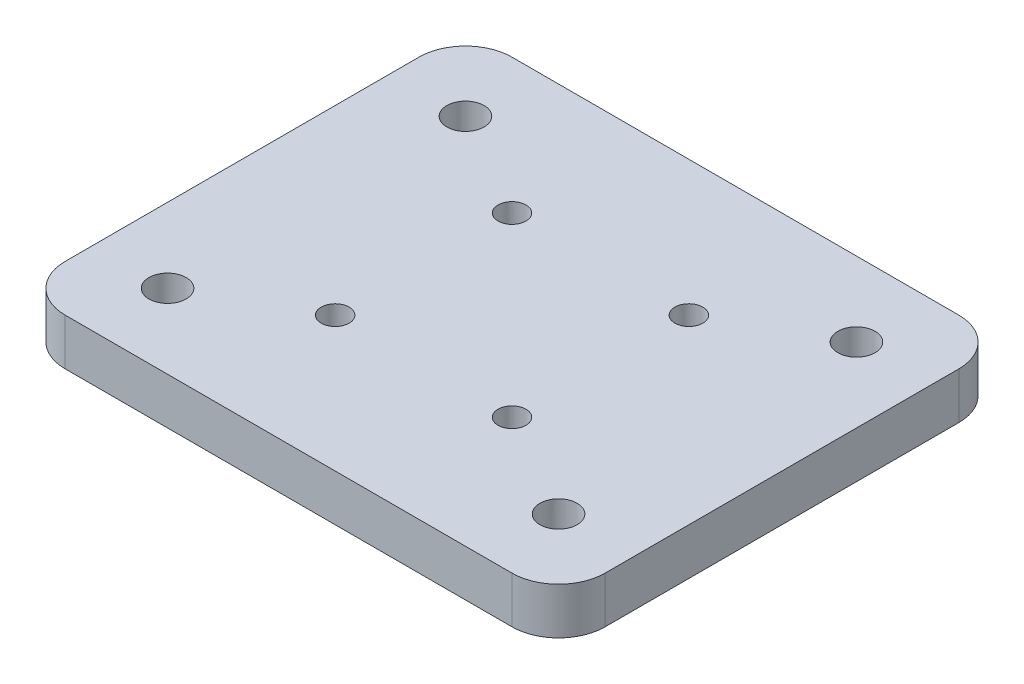
ISO-10303-21;
HEADER;
FILE_DESCRIPTION(('STEP AP214'),'2;1');
FILE_NAME('part.step','',(''),(''),'','','');
FILE_SCHEMA(('AUTOMOTIVE_DESIGN { 1 0 10303 214 1 1 1 1 }'));
ENDSEC;
DATA;
#1=APPLICATION_CONTEXT('core data for automotive mechanical design processes');
#2=APPLICATION_PROTOCOL_DEFINITION('international standard','automotive_design',2000,#1);
#3=PRODUCT_CONTEXT('',#1,'mechanical');
#4=PRODUCT('Part','Part','',(#3));
#5=PRODUCT_RELATED_PRODUCT_CATEGORY('part','',(#4));
#6=PRODUCT_DEFINITION_FORMATION('','',#4);
#7=PRODUCT_DEFINITION_CONTEXT('part definition',#1,'design');
#8=PRODUCT_DEFINITION('design','',#6,#7);
#9=PRODUCT_DEFINITION_SHAPE('','',#8);
#10=(LENGTH_UNIT() NAMED_UNIT(*) SI_UNIT(.MILLI.,.METRE.));
#11=(NAMED_UNIT(*) PLANE_ANGLE_UNIT() SI_UNIT($,.RADIAN.));
#12=(NAMED_UNIT(*) SI_UNIT($,.STERADIAN.) SOLID_ANGLE_UNIT());
#13=UNCERTAINTY_MEASURE_WITH_UNIT(LENGTH_MEASURE(1.E-05),#10,'distance_accuracy_value','');
#14=(GEOMETRIC_REPRESENTATION_CONTEXT(3) GLOBAL_UNCERTAINTY_ASSIGNED_CONTEXT((#13)) GLOBAL_UNIT_ASSIGNED_CONTEXT((#10,
#11,#12)) REPRESENTATION_CONTEXT('',''));
#15=CARTESIAN_POINT('',(0.,0.,0.));
#16=DIRECTION('',(0.,0.,1.));
#17=DIRECTION('',(1.,0.,0.));
#18=AXIS2_PLACEMENT_3D('',#15,#16,#17);
#19=CARTESIAN_POINT('',(-24.,5.,-19.));
#20=DIRECTION('',(0.,1.,0.));
#21=DIRECTION('',(0.,0.,1.));
#22=AXIS2_PLACEMENT_3D('',#19,#20,#21);
#23=CYLINDRICAL_SURFACE('',#22,5.);
#24=DIRECTION('',(0.,1.,0.));
#25=VECTOR('',#24,1.);
#26=CARTESIAN_POINT('',(-24.,5.,-24.));
#27=LINE('',#26,#25);
#28=CARTESIAN_POINT('',(-24.,0.,-24.));
#29=VERTEX_POINT('',#28);
#30=CARTESIAN_POINT('',(-24.,5.,-24.));
#31=VERTEX_POINT('',#30);
#32=EDGE_CURVE('E149',#29,#31,#27,.T.);
#33=ORIENTED_EDGE('',*,*,#32,.F.);
#34=CARTESIAN_POINT('',(-24.,0.,-19.));
#35=DIRECTION('',(0.,-1.,0.));
#36=DIRECTION('',(0.,0.,-1.));
#37=AXIS2_PLACEMENT_3D('',#34,#35,#36);
#38=CIRCLE('',#37,5.);
#39=CARTESIAN_POINT('',(-29.,0.,-19.));
#40=VERTEX_POINT('',#39);
#41=EDGE_CURVE('E43',#40,#29,#38,.T.);
#42=ORIENTED_EDGE('',*,*,#41,.F.);
#43=DIRECTION('',(0.,1.,0.));
#44=VECTOR('',#43,1.);
#45=CARTESIAN_POINT('',(-29.,5.,-19.));
#46=LINE('',#45,#44);
#47=CARTESIAN_POINT('',(-29.,5.,-19.));
#48=VERTEX_POINT('',#47);
#49=EDGE_CURVE('E103',#48,#40,#46,.F.);
#50=ORIENTED_EDGE('',*,*,#49,.F.);
#51=CARTESIAN_POINT('',(-24.,5.,-19.));
#52=DIRECTION('',(0.,-1.,0.));
#53=DIRECTION('',(0.,0.,-1.));
#54=AXIS2_PLACEMENT_3D('',#51,#52,#53);
#55=CIRCLE('',#54,5.);
#56=EDGE_CURVE('E11',#31,#48,#55,.F.);
#57=ORIENTED_EDGE('',*,*,#56,.F.);
#58=EDGE_LOOP('',(#33,#42,#50,#57));
#59=FACE_BOUND('',#58,.T.);
#60=ADVANCED_FACE('F36',(#59),#23,.T.);
#61=CARTESIAN_POINT('',(24.,5.,-19.));
#62=DIRECTION('',(0.,-1.,0.));
#63=DIRECTION('',(0.,0.,-1.));
#64=AXIS2_PLACEMENT_3D('',#61,#62,#63);
#65=CYLINDRICAL_SURFACE('',#64,5.);
#66=DIRECTION('',(0.,-1.,0.));
#67=VECTOR('',#66,1.);
#68=CARTESIAN_POINT('',(24.,5.,-24.));
#69=LINE('',#68,#67);
#70=CARTESIAN_POINT('',(24.,5.,-24.));
#71=VERTEX_POINT('',#70);
#72=CARTESIAN_POINT('',(24.,0.,-24.));
#73=VERTEX_POINT('',#72);
#74=EDGE_CURVE('E139',#71,#73,#69,.T.);
#75=ORIENTED_EDGE('',*,*,#74,.F.);
#76=CARTESIAN_POINT('',(24.,5.,-19.));
#77=DIRECTION('',(0.,-1.,0.));
#78=DIRECTION('',(0.,0.,-1.));
#79=AXIS2_PLACEMENT_3D('',#76,#77,#78);
#80=CIRCLE('',#79,5.);
#81=CARTESIAN_POINT('',(29.,5.,-19.));
#82=VERTEX_POINT('',#81);
#83=EDGE_CURVE('E145',#82,#71,#80,.F.);
#84=ORIENTED_EDGE('',*,*,#83,.F.);
#85=DIRECTION('',(0.,-1.,0.));
#86=VECTOR('',#85,1.);
#87=CARTESIAN_POINT('',(29.,5.,-19.));
#88=LINE('',#87,#86);
#89=CARTESIAN_POINT('',(29.,0.,-19.));
#90=VERTEX_POINT('',#89);
#91=EDGE_CURVE('E142',#90,#82,#88,.F.);
#92=ORIENTED_EDGE('',*,*,#91,.F.);
#93=CARTESIAN_POINT('',(24.,0.,-19.));
#94=DIRECTION('',(0.,-1.,0.));
#95=DIRECTION('',(0.,0.,-1.));
#96=AXIS2_PLACEMENT_3D('',#93,#94,#95);
#97=CIRCLE('',#96,5.);
#98=EDGE_CURVE('E147',#73,#90,#97,.T.);
#99=ORIENTED_EDGE('',*,*,#98,.F.);
#100=EDGE_LOOP('',(#75,#84,#92,#99));
#101=FACE_BOUND('',#100,.T.);
#102=ADVANCED_FACE('F235',(#101),#65,.T.);
#103=CARTESIAN_POINT('',(24.,5.,19.));
#104=DIRECTION('',(0.,-1.,0.));
#105=DIRECTION('',(0.,0.,-1.));
#106=AXIS2_PLACEMENT_3D('',#103,#104,#105);
#107=CYLINDRICAL_SURFACE('',#106,5.);
#108=DIRECTION('',(0.,-1.,0.));
#109=VECTOR('',#108,1.);
#110=CARTESIAN_POINT('',(29.,5.,19.));
#111=LINE('',#110,#109);
#112=CARTESIAN_POINT('',(29.,5.,19.));
#113=VERTEX_POINT('',#112);
#114=CARTESIAN_POINT('',(29.,0.,19.));
#115=VERTEX_POINT('',#114);
#116=EDGE_CURVE('E129',#113,#115,#111,.T.);
#117=ORIENTED_EDGE('',*,*,#116,.F.);
#118=CARTESIAN_POINT('',(24.,5.,19.));
#119=DIRECTION('',(0.,-1.,0.));
#120=DIRECTION('',(0.,0.,-1.));
#121=AXIS2_PLACEMENT_3D('',#118,#119,#120);
#122=CIRCLE('',#121,5.);
#123=CARTESIAN_POINT('',(24.,5.,24.));
#124=VERTEX_POINT('',#123);
#125=EDGE_CURVE('E135',#124,#113,#122,.F.);
#126=ORIENTED_EDGE('',*,*,#125,.F.);
#127=DIRECTION('',(0.,-1.,0.));
#128=VECTOR('',#127,1.);
#129=CARTESIAN_POINT('',(24.,5.,24.));
#130=LINE('',#129,#128);
#131=CARTESIAN_POINT('',(24.,0.,24.));
#132=VERTEX_POINT('',#131);
#133=EDGE_CURVE('E132',#132,#124,#130,.F.);
#134=ORIENTED_EDGE('',*,*,#133,.F.);
#135=CARTESIAN_POINT('',(24.,0.,19.));
#136=DIRECTION('',(0.,-1.,0.));
#137=DIRECTION('',(0.,0.,-1.));
#138=AXIS2_PLACEMENT_3D('',#135,#136,#137);
#139=CIRCLE('',#138,5.);
#140=EDGE_CURVE('E137',#115,#132,#139,.T.);
#141=ORIENTED_EDGE('',*,*,#140,.F.);
#142=EDGE_LOOP('',(#117,#126,#134,#141));
#143=FACE_BOUND('',#142,.T.);
#144=ADVANCED_FACE('F242',(#143),#107,.T.);
#145=CARTESIAN_POINT('',(-24.,5.,19.));
#146=DIRECTION('',(0.,1.,0.));
#147=DIRECTION('',(0.,0.,1.));
#148=AXIS2_PLACEMENT_3D('',#145,#146,#147);
#149=CYLINDRICAL_SURFACE('',#148,5.);
#150=DIRECTION('',(0.,1.,0.));
#151=VECTOR('',#150,1.);
#152=CARTESIAN_POINT('',(-29.,5.,19.));
#153=LINE('',#152,#151);
#154=CARTESIAN_POINT('',(-29.,0.,19.));
#155=VERTEX_POINT('',#154);
#156=CARTESIAN_POINT('',(-29.,5.,19.));
#157=VERTEX_POINT('',#156);
#158=EDGE_CURVE('E102',#155,#157,#153,.T.);
#159=ORIENTED_EDGE('',*,*,#158,.F.);
#160=CARTESIAN_POINT('',(-24.,0.,19.));
#161=DIRECTION('',(0.,-1.,0.));
#162=DIRECTION('',(0.,0.,-1.));
#163=AXIS2_PLACEMENT_3D('',#160,#161,#162);
#164=CIRCLE('',#163,5.);
#165=CARTESIAN_POINT('',(-24.,0.,24.));
#166=VERTEX_POINT('',#165);
#167=EDGE_CURVE('E109',#166,#155,#164,.T.);
#168=ORIENTED_EDGE('',*,*,#167,.F.);
#169=DIRECTION('',(0.,1.,0.));
#170=VECTOR('',#169,1.);
#171=CARTESIAN_POINT('',(-24.,5.,24.));
#172=LINE('',#171,#170);
#173=CARTESIAN_POINT('',(-24.,5.,24.));
#174=VERTEX_POINT('',#173);
#175=EDGE_CURVE('E116',#174,#166,#172,.F.);
#176=ORIENTED_EDGE('',*,*,#175,.F.);
#177=CARTESIAN_POINT('',(-24.,5.,19.));
#178=DIRECTION('',(0.,-1.,0.));
#179=DIRECTION('',(0.,0.,-1.));
#180=AXIS2_PLACEMENT_3D('',#177,#178,#179);
#181=CIRCLE('',#180,5.);
#182=EDGE_CURVE('E115',#157,#174,#181,.F.);
#183=ORIENTED_EDGE('',*,*,#182,.F.);
#184=EDGE_LOOP('',(#159,#168,#176,#183));
#185=FACE_BOUND('',#184,.T.);
#186=ADVANCED_FACE('F119',(#185),#149,.T.);
#187=CARTESIAN_POINT('',(29.,5.,24.));
#188=DIRECTION('',(-1.,0.,0.));
#189=DIRECTION('',(0.,0.,1.));
#190=AXIS2_PLACEMENT_3D('',#187,#188,#189);
#191=PLANE('',#190);
#192=DIRECTION('',(0.,0.,-1.));
#193=VECTOR('',#192,1.);
#194=CARTESIAN_POINT('',(29.,0.,24.));
#195=LINE('',#194,#193);
#196=EDGE_CURVE('E158',#115,#90,#195,.T.);
#197=ORIENTED_EDGE('',*,*,#196,.T.);
#198=ORIENTED_EDGE('',*,*,#91,.T.);
#199=DIRECTION('',(0.,0.,-1.));
#200=VECTOR('',#199,1.);
#201=CARTESIAN_POINT('',(29.,5.,24.));
#202=LINE('',#201,#200);
#203=EDGE_CURVE('E167',#113,#82,#202,.T.);
#204=ORIENTED_EDGE('',*,*,#203,.F.);
#205=ORIENTED_EDGE('',*,*,#116,.T.);
#206=EDGE_LOOP('',(#197,#198,#204,#205));
#207=FACE_BOUND('',#206,.T.);
#208=ADVANCED_FACE('F239',(#207),#191,.F.);
#209=CARTESIAN_POINT('',(-29.,5.,-24.));
#210=DIRECTION('',(0.,0.,1.));
#211=DIRECTION('',(1.,0.,0.));
#212=AXIS2_PLACEMENT_3D('',#209,#210,#211);
#213=PLANE('',#212);
#214=DIRECTION('',(-1.,0.,0.));
#215=VECTOR('',#214,1.);
#216=CARTESIAN_POINT('',(-29.,0.,-24.));
#217=LINE('',#216,#215);
#218=EDGE_CURVE('E106',#73,#29,#217,.T.);
#219=ORIENTED_EDGE('',*,*,#218,.T.);
#220=ORIENTED_EDGE('',*,*,#32,.T.);
#221=DIRECTION('',(-1.,0.,0.));
#222=VECTOR('',#221,1.);
#223=CARTESIAN_POINT('',(-29.,5.,-24.));
#224=LINE('',#223,#222);
#225=EDGE_CURVE('E165',#71,#31,#224,.T.);
#226=ORIENTED_EDGE('',*,*,#225,.F.);
#227=ORIENTED_EDGE('',*,*,#74,.T.);
#228=EDGE_LOOP('',(#219,#220,#226,#227));
#229=FACE_BOUND('',#228,.T.);
#230=ADVANCED_FACE('F156',(#229),#213,.F.);
#231=CARTESIAN_POINT('',(-29.,5.,24.));
#232=DIRECTION('',(1.,0.,0.));
#233=DIRECTION('',(0.,0.,-1.));
#234=AXIS2_PLACEMENT_3D('',#231,#232,#233);
#235=PLANE('',#234);
#236=DIRECTION('',(0.,0.,1.));
#237=VECTOR('',#236,1.);
#238=CARTESIAN_POINT('',(-29.,5.,24.));
#239=LINE('',#238,#237);
#240=EDGE_CURVE('E124',#48,#157,#239,.T.);
#241=ORIENTED_EDGE('',*,*,#240,.F.);
#242=ORIENTED_EDGE('',*,*,#49,.T.);
#243=DIRECTION('',(0.,0.,1.));
#244=VECTOR('',#243,1.);
#245=CARTESIAN_POINT('',(-29.,0.,24.));
#246=LINE('',#245,#244);
#247=EDGE_CURVE('E97',#40,#155,#246,.T.);
#248=ORIENTED_EDGE('',*,*,#247,.T.);
#249=ORIENTED_EDGE('',*,*,#158,.T.);
#250=EDGE_LOOP('',(#241,#242,#248,#249));
#251=FACE_BOUND('',#250,.T.);
#252=ADVANCED_FACE('F100',(#251),#235,.F.);
#253=CARTESIAN_POINT('',(-29.,5.,24.));
#254=DIRECTION('',(0.,0.,-1.));
#255=DIRECTION('',(-1.,0.,0.));
#256=AXIS2_PLACEMENT_3D('',#253,#254,#255);
#257=PLANE('',#256);
#258=DIRECTION('',(1.,0.,0.));
#259=VECTOR('',#258,1.);
#260=CARTESIAN_POINT('',(-29.,0.,24.));
#261=LINE('',#260,#259);
#262=EDGE_CURVE('E105',#166,#132,#261,.T.);
#263=ORIENTED_EDGE('',*,*,#262,.T.);
#264=ORIENTED_EDGE('',*,*,#133,.T.);
#265=DIRECTION('',(1.,0.,0.));
#266=VECTOR('',#265,1.);
#267=CARTESIAN_POINT('',(-29.,5.,24.));
#268=LINE('',#267,#266);
#269=EDGE_CURVE('E120',#174,#124,#268,.T.);
#270=ORIENTED_EDGE('',*,*,#269,.F.);
#271=ORIENTED_EDGE('',*,*,#175,.T.);
#272=EDGE_LOOP('',(#263,#264,#270,#271));
#273=FACE_BOUND('',#272,.T.);
#274=ADVANCED_FACE('F224',(#273),#257,.F.);
#275=CARTESIAN_POINT('',(0.,5.,0.));
#276=DIRECTION('',(0.,-1.,0.));
#277=DIRECTION('',(0.,0.,-1.));
#278=AXIS2_PLACEMENT_3D('',#275,#276,#277);
#279=PLANE('',#278);
#280=CARTESIAN_POINT('',(-21.,5.,16.));
#281=DIRECTION('',(0.,1.,0.));
#282=DIRECTION('',(0.,0.,-1.));
#283=AXIS2_PLACEMENT_3D('',#280,#281,#282);
#284=CIRCLE('',#283,2.);
#285=CARTESIAN_POINT('',(-21.,5.,14.));
#286=VERTEX_POINT('',#285);
#287=EDGE_CURVE('E193',#286,#286,#284,.T.);
#288=ORIENTED_EDGE('',*,*,#287,.F.);
#289=EDGE_LOOP('',(#288));
#290=FACE_BOUND('',#289,.T.);
#291=CARTESIAN_POINT('',(-21.,5.,-16.));
#292=DIRECTION('',(0.,1.,0.));
#293=DIRECTION('',(0.,0.,1.));
#294=AXIS2_PLACEMENT_3D('',#291,#292,#293);
#295=CIRCLE('',#294,2.);
#296=CARTESIAN_POINT('',(-21.,5.,-14.));
#297=VERTEX_POINT('',#296);
#298=EDGE_CURVE('E187',#297,#297,#295,.T.);
#299=ORIENTED_EDGE('',*,*,#298,.F.);
#300=EDGE_LOOP('',(#299));
#301=FACE_BOUND('',#300,.T.);
#302=CARTESIAN_POINT('',(21.,5.,-16.));
#303=DIRECTION('',(0.,1.,0.));
#304=DIRECTION('',(0.,0.,-1.));
#305=AXIS2_PLACEMENT_3D('',#302,#303,#304);
#306=CIRCLE('',#305,2.);
#307=CARTESIAN_POINT('',(21.,5.,-18.));
#308=VERTEX_POINT('',#307);
#309=EDGE_CURVE('E179',#308,#308,#306,.T.);
#310=ORIENTED_EDGE('',*,*,#309,.F.);
#311=EDGE_LOOP('',(#310));
#312=FACE_BOUND('',#311,.T.);
#313=CARTESIAN_POINT('',(-9.49999999999999,5.,9.50000000000004));
#314=DIRECTION('',(0.,1.,0.));
#315=DIRECTION('',(0.,0.,-1.));
#316=AXIS2_PLACEMENT_3D('',#313,#314,#315);
#317=CIRCLE('',#316,1.5);
#318=CARTESIAN_POINT('',(-9.49999999999999,5.,8.00000000000004));
#319=VERTEX_POINT('',#318);
#320=EDGE_CURVE('E180',#319,#319,#317,.T.);
#321=ORIENTED_EDGE('',*,*,#320,.F.);
#322=EDGE_LOOP('',(#321));
#323=FACE_BOUND('',#322,.T.);
#324=CARTESIAN_POINT('',(9.49999999999999,5.,9.50000000000001));
#325=DIRECTION('',(0.,1.,0.));
#326=DIRECTION('',(0.,0.,1.));
#327=AXIS2_PLACEMENT_3D('',#324,#325,#326);
#328=CIRCLE('',#327,1.5);
#329=CARTESIAN_POINT('',(9.49999999999999,5.,11.));
#330=VERTEX_POINT('',#329);
#331=EDGE_CURVE('E210',#330,#330,#328,.T.);
#332=ORIENTED_EDGE('',*,*,#331,.F.);
#333=EDGE_LOOP('',(#332));
#334=FACE_BOUND('',#333,.T.);
#335=CARTESIAN_POINT('',(9.49999999999999,5.,-9.49999999999998));
#336=DIRECTION('',(0.,1.,0.));
#337=DIRECTION('',(0.,0.,-1.));
#338=AXIS2_PLACEMENT_3D('',#335,#336,#337);
#339=CIRCLE('',#338,1.5);
#340=CARTESIAN_POINT('',(9.49999999999999,5.,-11.));
#341=VERTEX_POINT('',#340);
#342=EDGE_CURVE('E203',#341,#341,#339,.T.);
#343=ORIENTED_EDGE('',*,*,#342,.F.);
#344=EDGE_LOOP('',(#343));
#345=FACE_BOUND('',#344,.T.);
#346=CARTESIAN_POINT('',(-9.50000000000001,5.,-9.49999999999998));
#347=DIRECTION('',(0.,1.,0.));
#348=DIRECTION('',(0.,0.,1.));
#349=AXIS2_PLACEMENT_3D('',#346,#347,#348);
#350=CIRCLE('',#349,1.5);
#351=CARTESIAN_POINT('',(-9.50000000000001,5.,-7.99999999999998));
#352=VERTEX_POINT('',#351);
#353=EDGE_CURVE('E204',#352,#352,#350,.T.);
#354=ORIENTED_EDGE('',*,*,#353,.F.);
#355=EDGE_LOOP('',(#354));
#356=FACE_BOUND('',#355,.T.);
#357=CARTESIAN_POINT('',(21.,5.,16.));
#358=DIRECTION('',(0.,1.,0.));
#359=DIRECTION('',(0.,0.,1.));
#360=AXIS2_PLACEMENT_3D('',#357,#358,#359);
#361=CIRCLE('',#360,2.);
#362=CARTESIAN_POINT('',(21.,5.,18.));
#363=VERTEX_POINT('',#362);
#364=EDGE_CURVE('E172',#363,#363,#361,.T.);
#365=ORIENTED_EDGE('',*,*,#364,.F.);
#366=EDGE_LOOP('',(#365));
#367=FACE_BOUND('',#366,.T.);
#368=ORIENTED_EDGE('',*,*,#225,.T.);
#369=ORIENTED_EDGE('',*,*,#56,.T.);
#370=ORIENTED_EDGE('',*,*,#240,.T.);
#371=ORIENTED_EDGE('',*,*,#182,.T.);
#372=ORIENTED_EDGE('',*,*,#269,.T.);
#373=ORIENTED_EDGE('',*,*,#125,.T.);
#374=ORIENTED_EDGE('',*,*,#203,.T.);
#375=ORIENTED_EDGE('',*,*,#83,.T.);
#376=EDGE_LOOP('',(#368,#369,#370,#371,#372,#373,#374,#375));
#377=FACE_BOUND('',#376,.T.);
#378=ADVANCED_FACE('F221',(#290,#301,#312,#323,#334,#345,#356,#367,#377),#279,.F.);
#379=CARTESIAN_POINT('',(0.,0.,0.));
#380=DIRECTION('',(0.,-1.,0.));
#381=DIRECTION('',(0.,0.,-1.));
#382=AXIS2_PLACEMENT_3D('',#379,#380,#381);
#383=PLANE('',#382);
#384=CARTESIAN_POINT('',(-21.,0.,16.));
#385=DIRECTION('',(0.,-1.,0.));
#386=DIRECTION('',(0.,0.,-1.));
#387=AXIS2_PLACEMENT_3D('',#384,#385,#386);
#388=CIRCLE('',#387,2.);
#389=CARTESIAN_POINT('',(-21.,0.,14.));
#390=VERTEX_POINT('',#389);
#391=EDGE_CURVE('E175',#390,#390,#388,.F.);
#392=ORIENTED_EDGE('',*,*,#391,.T.);
#393=EDGE_LOOP('',(#392));
#394=FACE_BOUND('',#393,.T.);
#395=CARTESIAN_POINT('',(-21.,0.,-16.));
#396=DIRECTION('',(0.,-1.,0.));
#397=DIRECTION('',(0.,0.,-1.));
#398=AXIS2_PLACEMENT_3D('',#395,#396,#397);
#399=CIRCLE('',#398,2.);
#400=CARTESIAN_POINT('',(-21.,0.,-18.));
#401=VERTEX_POINT('',#400);
#402=EDGE_CURVE('E190',#401,#401,#399,.F.);
#403=ORIENTED_EDGE('',*,*,#402,.T.);
#404=EDGE_LOOP('',(#403));
#405=FACE_BOUND('',#404,.T.);
#406=CARTESIAN_POINT('',(21.,0.,-16.));
#407=DIRECTION('',(0.,-1.,0.));
#408=DIRECTION('',(0.,0.,-1.));
#409=AXIS2_PLACEMENT_3D('',#406,#407,#408);
#410=CIRCLE('',#409,2.);
#411=CARTESIAN_POINT('',(21.,0.,-18.));
#412=VERTEX_POINT('',#411);
#413=EDGE_CURVE('E184',#412,#412,#410,.F.);
#414=ORIENTED_EDGE('',*,*,#413,.T.);
#415=EDGE_LOOP('',(#414));
#416=FACE_BOUND('',#415,.T.);
#417=CARTESIAN_POINT('',(-9.49999999999999,0.,9.50000000000004));
#418=DIRECTION('',(0.,-1.,0.));
#419=DIRECTION('',(0.,0.,-1.));
#420=AXIS2_PLACEMENT_3D('',#417,#418,#419);
#421=CIRCLE('',#420,1.5);
#422=CARTESIAN_POINT('',(-9.49999999999999,0.,8.00000000000004));
#423=VERTEX_POINT('',#422);
#424=EDGE_CURVE('E176',#423,#423,#421,.F.);
#425=ORIENTED_EDGE('',*,*,#424,.T.);
#426=EDGE_LOOP('',(#425));
#427=FACE_BOUND('',#426,.T.);
#428=CARTESIAN_POINT('',(9.49999999999999,0.,9.50000000000001));
#429=DIRECTION('',(0.,-1.,0.));
#430=DIRECTION('',(0.,0.,-1.));
#431=AXIS2_PLACEMENT_3D('',#428,#429,#430);
#432=CIRCLE('',#431,1.5);
#433=CARTESIAN_POINT('',(9.49999999999999,0.,8.00000000000001));
#434=VERTEX_POINT('',#433);
#435=EDGE_CURVE('E183',#434,#434,#432,.F.);
#436=ORIENTED_EDGE('',*,*,#435,.T.);
#437=EDGE_LOOP('',(#436));
#438=FACE_BOUND('',#437,.T.);
#439=CARTESIAN_POINT('',(9.49999999999999,0.,-9.49999999999998));
#440=DIRECTION('',(0.,-1.,0.));
#441=DIRECTION('',(0.,0.,-1.));
#442=AXIS2_PLACEMENT_3D('',#439,#440,#441);
#443=CIRCLE('',#442,1.5);
#444=CARTESIAN_POINT('',(9.49999999999999,0.,-11.));
#445=VERTEX_POINT('',#444);
#446=EDGE_CURVE('E207',#445,#445,#443,.F.);
#447=ORIENTED_EDGE('',*,*,#446,.T.);
#448=EDGE_LOOP('',(#447));
#449=FACE_BOUND('',#448,.T.);
#450=CARTESIAN_POINT('',(-9.50000000000001,0.,-9.49999999999998));
#451=DIRECTION('',(0.,-1.,0.));
#452=DIRECTION('',(0.,0.,-1.));
#453=AXIS2_PLACEMENT_3D('',#450,#451,#452);
#454=CIRCLE('',#453,1.5);
#455=CARTESIAN_POINT('',(-9.50000000000001,0.,-11.));
#456=VERTEX_POINT('',#455);
#457=EDGE_CURVE('E200',#456,#456,#454,.F.);
#458=ORIENTED_EDGE('',*,*,#457,.T.);
#459=EDGE_LOOP('',(#458));
#460=FACE_BOUND('',#459,.T.);
#461=CARTESIAN_POINT('',(21.,0.,16.));
#462=DIRECTION('',(0.,-1.,0.));
#463=DIRECTION('',(0.,0.,-1.));
#464=AXIS2_PLACEMENT_3D('',#461,#462,#463);
#465=CIRCLE('',#464,2.);
#466=CARTESIAN_POINT('',(21.,0.,14.));
#467=VERTEX_POINT('',#466);
#468=EDGE_CURVE('E161',#467,#467,#465,.F.);
#469=ORIENTED_EDGE('',*,*,#468,.T.);
#470=EDGE_LOOP('',(#469));
#471=FACE_BOUND('',#470,.T.);
#472=ORIENTED_EDGE('',*,*,#247,.F.);
#473=ORIENTED_EDGE('',*,*,#41,.T.);
#474=ORIENTED_EDGE('',*,*,#218,.F.);
#475=ORIENTED_EDGE('',*,*,#98,.T.);
#476=ORIENTED_EDGE('',*,*,#196,.F.);
#477=ORIENTED_EDGE('',*,*,#140,.T.);
#478=ORIENTED_EDGE('',*,*,#262,.F.);
#479=ORIENTED_EDGE('',*,*,#167,.T.);
#480=EDGE_LOOP('',(#472,#473,#474,#475,#476,#477,#478,#479));
#481=FACE_BOUND('',#480,.T.);
#482=ADVANCED_FACE('F110',(#394,#405,#416,#427,#438,#449,#460,#471,#481),#383,.T.);
#483=CARTESIAN_POINT('',(21.,-5.65685424949236,16.));
#484=DIRECTION('',(0.,1.,0.));
#485=DIRECTION('',(0.,0.,1.));
#486=AXIS2_PLACEMENT_3D('',#483,#484,#485);
#487=CYLINDRICAL_SURFACE('',#486,2.);
#488=ORIENTED_EDGE('',*,*,#364,.T.);
#489=EDGE_LOOP('',(#488));
#490=FACE_BOUND('',#489,.T.);
#491=ORIENTED_EDGE('',*,*,#468,.F.);
#492=EDGE_LOOP('',(#491));
#493=FACE_BOUND('',#492,.T.);
#494=ADVANCED_FACE('F287',(#490,#493),#487,.F.);
#495=CARTESIAN_POINT('',(-9.50000000000001,-5.65685424949236,-9.49999999999999));
#496=DIRECTION('',(0.,1.,0.));
#497=DIRECTION('',(0.,0.,1.));
#498=AXIS2_PLACEMENT_3D('',#495,#496,#497);
#499=CYLINDRICAL_SURFACE('',#498,1.5);
#500=ORIENTED_EDGE('',*,*,#353,.T.);
#501=EDGE_LOOP('',(#500));
#502=FACE_BOUND('',#501,.T.);
#503=ORIENTED_EDGE('',*,*,#457,.F.);
#504=EDGE_LOOP('',(#503));
#505=FACE_BOUND('',#504,.T.);
#506=ADVANCED_FACE('F294',(#502,#505),#499,.F.);
#507=CARTESIAN_POINT('',(9.49999999999999,-5.65685424949236,-9.49999999999998));
#508=DIRECTION('',(0.,1.,0.));
#509=DIRECTION('',(0.,0.,1.));
#510=AXIS2_PLACEMENT_3D('',#507,#508,#509);
#511=CYLINDRICAL_SURFACE('',#510,1.5);
#512=ORIENTED_EDGE('',*,*,#342,.T.);
#513=EDGE_LOOP('',(#512));
#514=FACE_BOUND('',#513,.T.);
#515=ORIENTED_EDGE('',*,*,#446,.F.);
#516=EDGE_LOOP('',(#515));
#517=FACE_BOUND('',#516,.T.);
#518=ADVANCED_FACE('F302',(#514,#517),#511,.F.);
#519=CARTESIAN_POINT('',(9.49999999999999,-5.65685424949236,9.50000000000001));
#520=DIRECTION('',(0.,1.,0.));
#521=DIRECTION('',(0.,0.,1.));
#522=AXIS2_PLACEMENT_3D('',#519,#520,#521);
#523=CYLINDRICAL_SURFACE('',#522,1.5);
#524=ORIENTED_EDGE('',*,*,#331,.T.);
#525=EDGE_LOOP('',(#524));
#526=FACE_BOUND('',#525,.T.);
#527=ORIENTED_EDGE('',*,*,#435,.F.);
#528=EDGE_LOOP('',(#527));
#529=FACE_BOUND('',#528,.T.);
#530=ADVANCED_FACE('F218',(#526,#529),#523,.F.);
#531=CARTESIAN_POINT('',(-9.49999999999999,-5.65685424949236,9.50000000000004));
#532=DIRECTION('',(0.,1.,0.));
#533=DIRECTION('',(0.,0.,1.));
#534=AXIS2_PLACEMENT_3D('',#531,#532,#533);
#535=CYLINDRICAL_SURFACE('',#534,1.5);
#536=ORIENTED_EDGE('',*,*,#320,.T.);
#537=EDGE_LOOP('',(#536));
#538=FACE_BOUND('',#537,.T.);
#539=ORIENTED_EDGE('',*,*,#424,.F.);
#540=EDGE_LOOP('',(#539));
#541=FACE_BOUND('',#540,.T.);
#542=ADVANCED_FACE('F317',(#538,#541),#535,.F.);
#543=CARTESIAN_POINT('',(21.,-5.65685424949236,-16.));
#544=DIRECTION('',(0.,1.,0.));
#545=DIRECTION('',(0.,0.,1.));
#546=AXIS2_PLACEMENT_3D('',#543,#544,#545);
#547=CYLINDRICAL_SURFACE('',#546,2.);
#548=ORIENTED_EDGE('',*,*,#309,.T.);
#549=EDGE_LOOP('',(#548));
#550=FACE_BOUND('',#549,.T.);
#551=ORIENTED_EDGE('',*,*,#413,.F.);
#552=EDGE_LOOP('',(#551));
#553=FACE_BOUND('',#552,.T.);
#554=ADVANCED_FACE('F324',(#550,#553),#547,.F.);
#555=CARTESIAN_POINT('',(-21.,-5.65685424949236,-16.));
#556=DIRECTION('',(0.,1.,0.));
#557=DIRECTION('',(0.,0.,1.));
#558=AXIS2_PLACEMENT_3D('',#555,#556,#557);
#559=CYLINDRICAL_SURFACE('',#558,2.);
#560=ORIENTED_EDGE('',*,*,#298,.T.);
#561=EDGE_LOOP('',(#560));
#562=FACE_BOUND('',#561,.T.);
#563=ORIENTED_EDGE('',*,*,#402,.F.);
#564=EDGE_LOOP('',(#563));
#565=FACE_BOUND('',#564,.T.);
#566=ADVANCED_FACE('F332',(#562,#565),#559,.F.);
#567=CARTESIAN_POINT('',(-21.,-5.65685424949236,16.));
#568=DIRECTION('',(0.,1.,0.));
#569=DIRECTION('',(0.,0.,1.));
#570=AXIS2_PLACEMENT_3D('',#567,#568,#569);
#571=CYLINDRICAL_SURFACE('',#570,2.);
#572=ORIENTED_EDGE('',*,*,#287,.T.);
#573=EDGE_LOOP('',(#572));
#574=FACE_BOUND('',#573,.T.);
#575=ORIENTED_EDGE('',*,*,#391,.F.);
#576=EDGE_LOOP('',(#575));
#577=FACE_BOUND('',#576,.T.);
#578=ADVANCED_FACE('F340',(#574,#577),#571,.F.);
#579=CLOSED_SHELL('',(#60,#102,#144,#186,#208,#230,#252,#274,#378,#482,#494,#506,#518,#530,#542,
#554,#566,#578));
#580=MANIFOLD_SOLID_BREP('B2',#579);
#581=ADVANCED_BREP_SHAPE_REPRESENTATION('',(#18,#580),#14);
#582=SHAPE_DEFINITION_REPRESENTATION(#9,#581);
ENDSEC;
END-ISO-10303-21;
